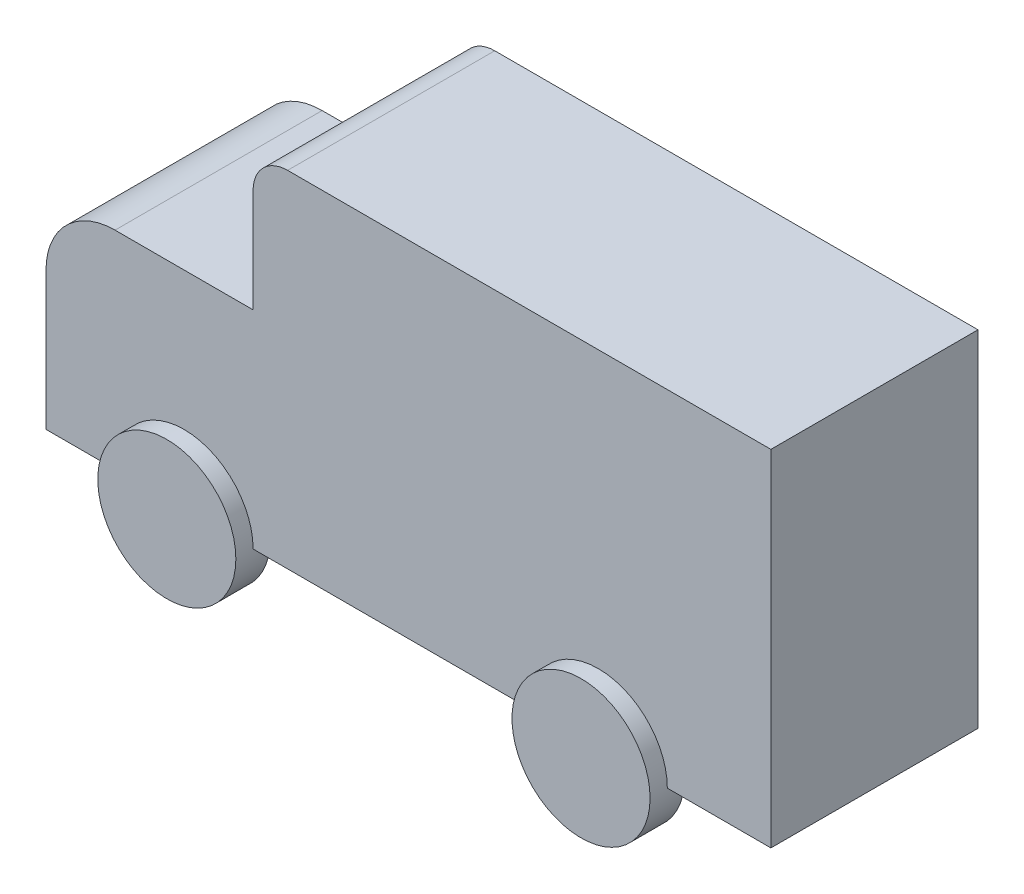
ISO-10303-21;
HEADER;
FILE_DESCRIPTION(('STEP AP214'),'2;1');
FILE_NAME('part.step','',(''),(''),'','','');
FILE_SCHEMA(('AUTOMOTIVE_DESIGN { 1 0 10303 214 1 1 1 1 }'));
ENDSEC;
DATA;
#1=APPLICATION_CONTEXT('core data for automotive mechanical design processes');
#2=APPLICATION_PROTOCOL_DEFINITION('international standard','automotive_design',2000,#1);
#3=PRODUCT_CONTEXT('',#1,'mechanical');
#4=PRODUCT('Part','Part','',(#3));
#5=PRODUCT_RELATED_PRODUCT_CATEGORY('part','',(#4));
#6=PRODUCT_DEFINITION_FORMATION('','',#4);
#7=PRODUCT_DEFINITION_CONTEXT('part definition',#1,'design');
#8=PRODUCT_DEFINITION('design','',#6,#7);
#9=PRODUCT_DEFINITION_SHAPE('','',#8);
#10=(LENGTH_UNIT() NAMED_UNIT(*) SI_UNIT(.MILLI.,.METRE.));
#11=(NAMED_UNIT(*) PLANE_ANGLE_UNIT() SI_UNIT($,.RADIAN.));
#12=(NAMED_UNIT(*) SI_UNIT($,.STERADIAN.) SOLID_ANGLE_UNIT());
#13=UNCERTAINTY_MEASURE_WITH_UNIT(LENGTH_MEASURE(1.E-05),#10,'distance_accuracy_value','');
#14=(GEOMETRIC_REPRESENTATION_CONTEXT(3) GLOBAL_UNCERTAINTY_ASSIGNED_CONTEXT((#13)) GLOBAL_UNIT_ASSIGNED_CONTEXT((#10,
#11,#12)) REPRESENTATION_CONTEXT('',''));
#15=CARTESIAN_POINT('',(0.,0.,0.));
#16=DIRECTION('',(0.,0.,1.));
#17=DIRECTION('',(1.,0.,0.));
#18=AXIS2_PLACEMENT_3D('',#15,#16,#17);
#19=CARTESIAN_POINT('',(0.,-1000.,-600.));
#20=DIRECTION('',(0.,-1.,0.));
#21=DIRECTION('',(1.,0.,0.));
#22=AXIS2_PLACEMENT_3D('',#19,#20,#21);
#23=PLANE('',#22);
#24=DIRECTION('',(0.,0.,1.));
#25=VECTOR('',#24,1.);
#26=CARTESIAN_POINT('',(900.,-1000.,-700.));
#27=LINE('',#26,#25);
#28=CARTESIAN_POINT('',(900.,-1000.,-600.));
#29=VERTEX_POINT('',#28);
#30=CARTESIAN_POINT('',(900.,-1000.,-500.));
#31=VERTEX_POINT('',#30);
#32=EDGE_CURVE('E146',#29,#31,#27,.T.);
#33=ORIENTED_EDGE('',*,*,#32,.F.);
#34=DIRECTION('',(1.,0.,0.));
#35=VECTOR('',#34,1.);
#36=CARTESIAN_POINT('',(0.,-1000.,-600.));
#37=LINE('',#36,#35);
#38=CARTESIAN_POINT('',(1500.,-1000.,-600.));
#39=VERTEX_POINT('',#38);
#40=EDGE_CURVE('E206',#29,#39,#37,.T.);
#41=ORIENTED_EDGE('',*,*,#40,.T.);
#42=DIRECTION('',(0.,0.,1.));
#43=VECTOR('',#42,1.);
#44=CARTESIAN_POINT('',(1500.,-1000.,-600.));
#45=LINE('',#44,#43);
#46=CARTESIAN_POINT('',(1500.,-1000.,600.));
#47=VERTEX_POINT('',#46);
#48=EDGE_CURVE('E258',#39,#47,#45,.T.);
#49=ORIENTED_EDGE('',*,*,#48,.T.);
#50=DIRECTION('',(1.,0.,0.));
#51=VECTOR('',#50,1.);
#52=CARTESIAN_POINT('',(0.,-1000.,600.));
#53=LINE('',#52,#51);
#54=CARTESIAN_POINT('',(900.,-1000.,600.));
#55=VERTEX_POINT('',#54);
#56=EDGE_CURVE('E227',#55,#47,#53,.T.);
#57=ORIENTED_EDGE('',*,*,#56,.F.);
#58=DIRECTION('',(0.,0.,-1.));
#59=VECTOR('',#58,1.);
#60=CARTESIAN_POINT('',(900.,-1000.,700.));
#61=LINE('',#60,#59);
#62=CARTESIAN_POINT('',(900.,-1000.,500.));
#63=VERTEX_POINT('',#62);
#64=EDGE_CURVE('E178',#55,#63,#61,.T.);
#65=ORIENTED_EDGE('',*,*,#64,.T.);
#66=DIRECTION('',(-1.,0.,0.));
#67=VECTOR('',#66,1.);
#68=CARTESIAN_POINT('',(0.,-1000.,500.));
#69=LINE('',#68,#67);
#70=CARTESIAN_POINT('',(99.9999999999995,-1000.,500.));
#71=VERTEX_POINT('',#70);
#72=EDGE_CURVE('E272',#63,#71,#69,.T.);
#73=ORIENTED_EDGE('',*,*,#72,.T.);
#74=DIRECTION('',(0.,0.,-1.));
#75=VECTOR('',#74,1.);
#76=CARTESIAN_POINT('',(99.9999999999995,-1000.,700.));
#77=LINE('',#76,#75);
#78=CARTESIAN_POINT('',(99.9999999999995,-1000.,600.));
#79=VERTEX_POINT('',#78);
#80=EDGE_CURVE('E183',#71,#79,#77,.F.);
#81=ORIENTED_EDGE('',*,*,#80,.T.);
#82=CARTESIAN_POINT('',(-1500.,-1000.,600.));
#83=VERTEX_POINT('',#82);
#84=EDGE_CURVE('E232',#83,#79,#53,.T.);
#85=ORIENTED_EDGE('',*,*,#84,.F.);
#86=DIRECTION('',(0.,0.,-1.));
#87=VECTOR('',#86,1.);
#88=CARTESIAN_POINT('',(-1500.,-1000.,700.));
#89=LINE('',#88,#87);
#90=CARTESIAN_POINT('',(-1500.,-1000.,500.));
#91=VERTEX_POINT('',#90);
#92=EDGE_CURVE('E190',#83,#91,#89,.T.);
#93=ORIENTED_EDGE('',*,*,#92,.T.);
#94=DIRECTION('',(-1.,0.,0.));
#95=VECTOR('',#94,1.);
#96=CARTESIAN_POINT('',(0.,-1000.,500.));
#97=LINE('',#96,#95);
#98=CARTESIAN_POINT('',(-2300.,-1000.,500.));
#99=VERTEX_POINT('',#98);
#100=EDGE_CURVE('E266',#91,#99,#97,.T.);
#101=ORIENTED_EDGE('',*,*,#100,.T.);
#102=DIRECTION('',(0.,0.,-1.));
#103=VECTOR('',#102,1.);
#104=CARTESIAN_POINT('',(-2300.,-1000.,700.));
#105=LINE('',#104,#103);
#106=CARTESIAN_POINT('',(-2300.,-1000.,600.));
#107=VERTEX_POINT('',#106);
#108=EDGE_CURVE('E195',#99,#107,#105,.F.);
#109=ORIENTED_EDGE('',*,*,#108,.T.);
#110=CARTESIAN_POINT('',(-2700.,-1000.,600.));
#111=VERTEX_POINT('',#110);
#112=EDGE_CURVE('E228',#111,#107,#53,.T.);
#113=ORIENTED_EDGE('',*,*,#112,.F.);
#114=DIRECTION('',(0.,0.,1.));
#115=VECTOR('',#114,1.);
#116=CARTESIAN_POINT('',(-2700.,-1000.,-600.));
#117=LINE('',#116,#115);
#118=CARTESIAN_POINT('',(-2700.,-1000.,-600.));
#119=VERTEX_POINT('',#118);
#120=EDGE_CURVE('E261',#119,#111,#117,.T.);
#121=ORIENTED_EDGE('',*,*,#120,.F.);
#122=CARTESIAN_POINT('',(-2300.,-1000.,-600.));
#123=VERTEX_POINT('',#122);
#124=EDGE_CURVE('E207',#119,#123,#37,.T.);
#125=ORIENTED_EDGE('',*,*,#124,.T.);
#126=DIRECTION('',(0.,0.,1.));
#127=VECTOR('',#126,1.);
#128=CARTESIAN_POINT('',(-2300.,-1000.,-700.));
#129=LINE('',#128,#127);
#130=CARTESIAN_POINT('',(-2300.,-1000.,-500.));
#131=VERTEX_POINT('',#130);
#132=EDGE_CURVE('E56',#131,#123,#129,.F.);
#133=ORIENTED_EDGE('',*,*,#132,.F.);
#134=DIRECTION('',(1.,0.,0.));
#135=VECTOR('',#134,1.);
#136=CARTESIAN_POINT('',(0.,-1000.,-500.));
#137=LINE('',#136,#135);
#138=CARTESIAN_POINT('',(-1500.,-1000.,-500.));
#139=VERTEX_POINT('',#138);
#140=EDGE_CURVE('E277',#131,#139,#137,.T.);
#141=ORIENTED_EDGE('',*,*,#140,.T.);
#142=DIRECTION('',(0.,0.,1.));
#143=VECTOR('',#142,1.);
#144=CARTESIAN_POINT('',(-1500.,-1000.,-700.));
#145=LINE('',#144,#143);
#146=CARTESIAN_POINT('',(-1500.,-1000.,-600.));
#147=VERTEX_POINT('',#146);
#148=EDGE_CURVE('E172',#147,#139,#145,.T.);
#149=ORIENTED_EDGE('',*,*,#148,.F.);
#150=CARTESIAN_POINT('',(99.9999999999995,-1000.,-600.));
#151=VERTEX_POINT('',#150);
#152=EDGE_CURVE('E161',#147,#151,#37,.T.);
#153=ORIENTED_EDGE('',*,*,#152,.T.);
#154=DIRECTION('',(0.,0.,1.));
#155=VECTOR('',#154,1.);
#156=CARTESIAN_POINT('',(99.9999999999995,-1000.,-700.));
#157=LINE('',#156,#155);
#158=CARTESIAN_POINT('',(99.9999999999995,-1000.,-500.));
#159=VERTEX_POINT('',#158);
#160=EDGE_CURVE('E48',#159,#151,#157,.F.);
#161=ORIENTED_EDGE('',*,*,#160,.F.);
#162=DIRECTION('',(1.,0.,0.));
#163=VECTOR('',#162,1.);
#164=CARTESIAN_POINT('',(0.,-1000.,-500.));
#165=LINE('',#164,#163);
#166=EDGE_CURVE('E11',#159,#31,#165,.T.);
#167=ORIENTED_EDGE('',*,*,#166,.T.);
#168=EDGE_LOOP('',(#33,#41,#49,#57,#65,#73,#81,#85,#93,#101,#109,#113,#121,#125,#133,#141,#149,
#153,#161,#167));
#169=FACE_BOUND('',#168,.T.);
#170=ADVANCED_FACE('F33',(#169),#23,.T.);
#171=CARTESIAN_POINT('',(-2300.,-200.,-600.));
#172=DIRECTION('',(0.,0.,1.));
#173=DIRECTION('',(1.,0.,0.));
#174=AXIS2_PLACEMENT_3D('',#171,#172,#173);
#175=CYLINDRICAL_SURFACE('',#174,400.);
#176=CARTESIAN_POINT('',(-2300.,-200.,600.));
#177=DIRECTION('',(0.,0.,1.));
#178=DIRECTION('',(1.,0.,0.));
#179=AXIS2_PLACEMENT_3D('',#176,#177,#178);
#180=CIRCLE('',#179,400.);
#181=CARTESIAN_POINT('',(-2700.,-200.000000000003,600.));
#182=VERTEX_POINT('',#181);
#183=CARTESIAN_POINT('',(-2300.,200.,600.));
#184=VERTEX_POINT('',#183);
#185=EDGE_CURVE('E198',#182,#184,#180,.F.);
#186=ORIENTED_EDGE('',*,*,#185,.T.);
#187=DIRECTION('',(0.,0.,1.));
#188=VECTOR('',#187,1.);
#189=CARTESIAN_POINT('',(-2300.,200.,-600.));
#190=LINE('',#189,#188);
#191=CARTESIAN_POINT('',(-2300.,200.,-600.));
#192=VERTEX_POINT('',#191);
#193=EDGE_CURVE('E243',#192,#184,#190,.T.);
#194=ORIENTED_EDGE('',*,*,#193,.F.);
#195=CARTESIAN_POINT('',(-2300.,-200.,-600.));
#196=DIRECTION('',(0.,0.,1.));
#197=DIRECTION('',(1.,0.,0.));
#198=AXIS2_PLACEMENT_3D('',#195,#196,#197);
#199=CIRCLE('',#198,400.);
#200=CARTESIAN_POINT('',(-2700.,-200.000000000003,-600.));
#201=VERTEX_POINT('',#200);
#202=EDGE_CURVE('E199',#201,#192,#199,.F.);
#203=ORIENTED_EDGE('',*,*,#202,.F.);
#204=DIRECTION('',(0.,0.,1.));
#205=VECTOR('',#204,1.);
#206=CARTESIAN_POINT('',(-2700.,-200.000000000003,-600.));
#207=LINE('',#206,#205);
#208=EDGE_CURVE('E221',#201,#182,#207,.T.);
#209=ORIENTED_EDGE('',*,*,#208,.T.);
#210=EDGE_LOOP('',(#186,#194,#203,#209));
#211=FACE_BOUND('',#210,.T.);
#212=ADVANCED_FACE('F35',(#211),#175,.T.);
#213=CARTESIAN_POINT('',(0.,200.,-600.));
#214=DIRECTION('',(0.,-1.,0.));
#215=DIRECTION('',(0.,0.,-1.));
#216=AXIS2_PLACEMENT_3D('',#213,#214,#215);
#217=PLANE('',#216);
#218=DIRECTION('',(1.,0.,0.));
#219=VECTOR('',#218,1.);
#220=CARTESIAN_POINT('',(0.,200.,600.));
#221=LINE('',#220,#219);
#222=CARTESIAN_POINT('',(-1500.,200.,600.));
#223=VERTEX_POINT('',#222);
#224=EDGE_CURVE('E203',#184,#223,#221,.T.);
#225=ORIENTED_EDGE('',*,*,#224,.T.);
#226=DIRECTION('',(0.,0.,1.));
#227=VECTOR('',#226,1.);
#228=CARTESIAN_POINT('',(-1500.,200.,-600.));
#229=LINE('',#228,#227);
#230=CARTESIAN_POINT('',(-1500.,200.,-600.));
#231=VERTEX_POINT('',#230);
#232=EDGE_CURVE('E247',#231,#223,#229,.T.);
#233=ORIENTED_EDGE('',*,*,#232,.F.);
#234=DIRECTION('',(1.,0.,0.));
#235=VECTOR('',#234,1.);
#236=CARTESIAN_POINT('',(0.,200.,-600.));
#237=LINE('',#236,#235);
#238=EDGE_CURVE('E219',#192,#231,#237,.T.);
#239=ORIENTED_EDGE('',*,*,#238,.F.);
#240=ORIENTED_EDGE('',*,*,#193,.T.);
#241=EDGE_LOOP('',(#225,#233,#239,#240));
#242=FACE_BOUND('',#241,.T.);
#243=ADVANCED_FACE('F319',(#242),#217,.F.);
#244=CARTESIAN_POINT('',(-1500.,0.,-600.));
#245=DIRECTION('',(1.,0.,0.));
#246=DIRECTION('',(0.,0.,-1.));
#247=AXIS2_PLACEMENT_3D('',#244,#245,#246);
#248=PLANE('',#247);
#249=DIRECTION('',(0.,1.,0.));
#250=VECTOR('',#249,1.);
#251=CARTESIAN_POINT('',(-1500.,0.,600.));
#252=LINE('',#251,#250);
#253=CARTESIAN_POINT('',(-1500.,799.999999999999,600.));
#254=VERTEX_POINT('',#253);
#255=EDGE_CURVE('E240',#223,#254,#252,.T.);
#256=ORIENTED_EDGE('',*,*,#255,.T.);
#257=DIRECTION('',(0.,0.,1.));
#258=VECTOR('',#257,1.);
#259=CARTESIAN_POINT('',(-1500.,799.999999999999,-600.));
#260=LINE('',#259,#258);
#261=CARTESIAN_POINT('',(-1500.,799.999999999999,-600.));
#262=VERTEX_POINT('',#261);
#263=EDGE_CURVE('E250',#262,#254,#260,.T.);
#264=ORIENTED_EDGE('',*,*,#263,.F.);
#265=DIRECTION('',(0.,1.,0.));
#266=VECTOR('',#265,1.);
#267=CARTESIAN_POINT('',(-1500.,0.,-600.));
#268=LINE('',#267,#266);
#269=EDGE_CURVE('E217',#231,#262,#268,.T.);
#270=ORIENTED_EDGE('',*,*,#269,.F.);
#271=ORIENTED_EDGE('',*,*,#232,.T.);
#272=EDGE_LOOP('',(#256,#264,#270,#271));
#273=FACE_BOUND('',#272,.T.);
#274=ADVANCED_FACE('F362',(#273),#248,.F.);
#275=CARTESIAN_POINT('',(-1300.,800.,-600.));
#276=DIRECTION('',(0.,0.,1.));
#277=DIRECTION('',(1.,0.,0.));
#278=AXIS2_PLACEMENT_3D('',#275,#276,#277);
#279=CYLINDRICAL_SURFACE('',#278,200.);
#280=CARTESIAN_POINT('',(-1300.,800.,600.));
#281=DIRECTION('',(0.,0.,1.));
#282=DIRECTION('',(1.,0.,0.));
#283=AXIS2_PLACEMENT_3D('',#280,#281,#282);
#284=CIRCLE('',#283,200.);
#285=CARTESIAN_POINT('',(-1300.,1000.,600.));
#286=VERTEX_POINT('',#285);
#287=EDGE_CURVE('E238',#254,#286,#284,.F.);
#288=ORIENTED_EDGE('',*,*,#287,.T.);
#289=DIRECTION('',(0.,0.,1.));
#290=VECTOR('',#289,1.);
#291=CARTESIAN_POINT('',(-1300.,1000.,-600.));
#292=LINE('',#291,#290);
#293=CARTESIAN_POINT('',(-1300.,1000.,-600.));
#294=VERTEX_POINT('',#293);
#295=EDGE_CURVE('E253',#294,#286,#292,.T.);
#296=ORIENTED_EDGE('',*,*,#295,.F.);
#297=CARTESIAN_POINT('',(-1300.,800.,-600.));
#298=DIRECTION('',(0.,0.,1.));
#299=DIRECTION('',(1.,0.,0.));
#300=AXIS2_PLACEMENT_3D('',#297,#298,#299);
#301=CIRCLE('',#300,200.);
#302=EDGE_CURVE('E215',#262,#294,#301,.F.);
#303=ORIENTED_EDGE('',*,*,#302,.F.);
#304=ORIENTED_EDGE('',*,*,#263,.T.);
#305=EDGE_LOOP('',(#288,#296,#303,#304));
#306=FACE_BOUND('',#305,.T.);
#307=ADVANCED_FACE('F366',(#306),#279,.T.);
#308=CARTESIAN_POINT('',(0.,1000.,-600.));
#309=DIRECTION('',(0.,-1.,0.));
#310=DIRECTION('',(0.,0.,-1.));
#311=AXIS2_PLACEMENT_3D('',#308,#309,#310);
#312=PLANE('',#311);
#313=DIRECTION('',(1.,0.,0.));
#314=VECTOR('',#313,1.);
#315=CARTESIAN_POINT('',(0.,1000.,600.));
#316=LINE('',#315,#314);
#317=CARTESIAN_POINT('',(1500.,1000.,600.));
#318=VERTEX_POINT('',#317);
#319=EDGE_CURVE('E235',#286,#318,#316,.T.);
#320=ORIENTED_EDGE('',*,*,#319,.T.);
#321=DIRECTION('',(0.,0.,1.));
#322=VECTOR('',#321,1.);
#323=CARTESIAN_POINT('',(1500.,1000.,-600.));
#324=LINE('',#323,#322);
#325=CARTESIAN_POINT('',(1500.,1000.,-600.));
#326=VERTEX_POINT('',#325);
#327=EDGE_CURVE('E256',#326,#318,#324,.T.);
#328=ORIENTED_EDGE('',*,*,#327,.F.);
#329=DIRECTION('',(1.,0.,0.));
#330=VECTOR('',#329,1.);
#331=CARTESIAN_POINT('',(0.,1000.,-600.));
#332=LINE('',#331,#330);
#333=EDGE_CURVE('E213',#294,#326,#332,.T.);
#334=ORIENTED_EDGE('',*,*,#333,.F.);
#335=ORIENTED_EDGE('',*,*,#295,.T.);
#336=EDGE_LOOP('',(#320,#328,#334,#335));
#337=FACE_BOUND('',#336,.T.);
#338=ADVANCED_FACE('F331',(#337),#312,.F.);
#339=CARTESIAN_POINT('',(1500.,0.,-600.));
#340=DIRECTION('',(1.,0.,0.));
#341=DIRECTION('',(0.,0.,-1.));
#342=AXIS2_PLACEMENT_3D('',#339,#340,#341);
#343=PLANE('',#342);
#344=DIRECTION('',(0.,1.,0.));
#345=VECTOR('',#344,1.);
#346=CARTESIAN_POINT('',(1500.,0.,600.));
#347=LINE('',#346,#345);
#348=EDGE_CURVE('E231',#47,#318,#347,.T.);
#349=ORIENTED_EDGE('',*,*,#348,.F.);
#350=ORIENTED_EDGE('',*,*,#48,.F.);
#351=DIRECTION('',(0.,1.,0.));
#352=VECTOR('',#351,1.);
#353=CARTESIAN_POINT('',(1500.,0.,-600.));
#354=LINE('',#353,#352);
#355=EDGE_CURVE('E210',#39,#326,#354,.T.);
#356=ORIENTED_EDGE('',*,*,#355,.T.);
#357=ORIENTED_EDGE('',*,*,#327,.T.);
#358=EDGE_LOOP('',(#349,#350,#356,#357));
#359=FACE_BOUND('',#358,.T.);
#360=ADVANCED_FACE('F286',(#359),#343,.T.);
#361=CARTESIAN_POINT('',(-2700.,0.,-600.));
#362=DIRECTION('',(-1.,0.,0.));
#363=DIRECTION('',(0.,0.,1.));
#364=AXIS2_PLACEMENT_3D('',#361,#362,#363);
#365=PLANE('',#364);
#366=DIRECTION('',(0.,-1.,0.));
#367=VECTOR('',#366,1.);
#368=CARTESIAN_POINT('',(-2700.,0.,600.));
#369=LINE('',#368,#367);
#370=EDGE_CURVE('E224',#182,#111,#369,.T.);
#371=ORIENTED_EDGE('',*,*,#370,.F.);
#372=ORIENTED_EDGE('',*,*,#208,.F.);
#373=DIRECTION('',(0.,-1.,0.));
#374=VECTOR('',#373,1.);
#375=CARTESIAN_POINT('',(-2700.,0.,-600.));
#376=LINE('',#375,#374);
#377=EDGE_CURVE('E202',#201,#119,#376,.T.);
#378=ORIENTED_EDGE('',*,*,#377,.T.);
#379=ORIENTED_EDGE('',*,*,#120,.T.);
#380=EDGE_LOOP('',(#371,#372,#378,#379));
#381=FACE_BOUND('',#380,.T.);
#382=ADVANCED_FACE('F323',(#381),#365,.T.);
#383=CARTESIAN_POINT('',(0.,0.,-600.));
#384=DIRECTION('',(0.,0.,1.));
#385=DIRECTION('',(1.,0.,0.));
#386=AXIS2_PLACEMENT_3D('',#383,#384,#385);
#387=PLANE('',#386);
#388=ORIENTED_EDGE('',*,*,#40,.F.);
#389=CARTESIAN_POINT('',(500.,-1000.,-600.));
#390=DIRECTION('',(0.,0.,1.));
#391=DIRECTION('',(1.,0.,0.));
#392=AXIS2_PLACEMENT_3D('',#389,#390,#391);
#393=CIRCLE('',#392,400.);
#394=EDGE_CURVE('E41',#29,#151,#393,.T.);
#395=ORIENTED_EDGE('',*,*,#394,.T.);
#396=ORIENTED_EDGE('',*,*,#152,.F.);
#397=CARTESIAN_POINT('',(-1900.,-1000.,-600.));
#398=DIRECTION('',(0.,0.,1.));
#399=DIRECTION('',(1.,0.,0.));
#400=AXIS2_PLACEMENT_3D('',#397,#398,#399);
#401=CIRCLE('',#400,400.);
#402=EDGE_CURVE('E275',#147,#123,#401,.T.);
#403=ORIENTED_EDGE('',*,*,#402,.T.);
#404=ORIENTED_EDGE('',*,*,#124,.F.);
#405=ORIENTED_EDGE('',*,*,#377,.F.);
#406=ORIENTED_EDGE('',*,*,#202,.T.);
#407=ORIENTED_EDGE('',*,*,#238,.T.);
#408=ORIENTED_EDGE('',*,*,#269,.T.);
#409=ORIENTED_EDGE('',*,*,#302,.T.);
#410=ORIENTED_EDGE('',*,*,#333,.T.);
#411=ORIENTED_EDGE('',*,*,#355,.F.);
#412=EDGE_LOOP('',(#388,#395,#396,#403,#404,#405,#406,#407,#408,#409,#410,#411));
#413=FACE_BOUND('',#412,.T.);
#414=ADVANCED_FACE('F280',(#413),#387,.F.);
#415=CARTESIAN_POINT('',(0.,0.,600.));
#416=DIRECTION('',(0.,0.,1.));
#417=DIRECTION('',(1.,0.,0.));
#418=AXIS2_PLACEMENT_3D('',#415,#416,#417);
#419=PLANE('',#418);
#420=ORIENTED_EDGE('',*,*,#84,.T.);
#421=CARTESIAN_POINT('',(500.,-1000.,600.));
#422=DIRECTION('',(0.,0.,1.));
#423=DIRECTION('',(1.,0.,0.));
#424=AXIS2_PLACEMENT_3D('',#421,#422,#423);
#425=CIRCLE('',#424,400.);
#426=EDGE_CURVE('E269',#79,#55,#425,.F.);
#427=ORIENTED_EDGE('',*,*,#426,.T.);
#428=ORIENTED_EDGE('',*,*,#56,.T.);
#429=ORIENTED_EDGE('',*,*,#348,.T.);
#430=ORIENTED_EDGE('',*,*,#319,.F.);
#431=ORIENTED_EDGE('',*,*,#287,.F.);
#432=ORIENTED_EDGE('',*,*,#255,.F.);
#433=ORIENTED_EDGE('',*,*,#224,.F.);
#434=ORIENTED_EDGE('',*,*,#185,.F.);
#435=ORIENTED_EDGE('',*,*,#370,.T.);
#436=ORIENTED_EDGE('',*,*,#112,.T.);
#437=CARTESIAN_POINT('',(-1900.,-1000.,600.));
#438=DIRECTION('',(0.,0.,1.));
#439=DIRECTION('',(1.,0.,0.));
#440=AXIS2_PLACEMENT_3D('',#437,#438,#439);
#441=CIRCLE('',#440,400.);
#442=EDGE_CURVE('E246',#107,#83,#441,.F.);
#443=ORIENTED_EDGE('',*,*,#442,.T.);
#444=EDGE_LOOP('',(#420,#427,#428,#429,#430,#431,#432,#433,#434,#435,#436,#443));
#445=FACE_BOUND('',#444,.T.);
#446=ADVANCED_FACE('F291',(#445),#419,.T.);
#447=CARTESIAN_POINT('',(-1900.,-1000.,700.));
#448=DIRECTION('',(0.,0.,-1.));
#449=DIRECTION('',(-1.,0.,0.));
#450=AXIS2_PLACEMENT_3D('',#447,#448,#449);
#451=CYLINDRICAL_SURFACE('',#450,400.);
#452=ORIENTED_EDGE('',*,*,#108,.F.);
#453=CARTESIAN_POINT('',(-1900.,-1000.,500.));
#454=DIRECTION('',(0.,0.,1.));
#455=DIRECTION('',(1.,0.,0.));
#456=AXIS2_PLACEMENT_3D('',#453,#454,#455);
#457=CIRCLE('',#456,400.);
#458=EDGE_CURVE('E186',#99,#91,#457,.T.);
#459=ORIENTED_EDGE('',*,*,#458,.T.);
#460=ORIENTED_EDGE('',*,*,#92,.F.);
#461=ORIENTED_EDGE('',*,*,#442,.F.);
#462=EDGE_LOOP('',(#452,#459,#460,#461));
#463=FACE_BOUND('',#462,.T.);
#464=CARTESIAN_POINT('',(-1900.,-1000.,700.));
#465=DIRECTION('',(0.,0.,1.));
#466=DIRECTION('',(1.,0.,0.));
#467=AXIS2_PLACEMENT_3D('',#464,#465,#466);
#468=CIRCLE('',#467,400.);
#469=CARTESIAN_POINT('',(-1500.,-1000.,700.));
#470=VERTEX_POINT('',#469);
#471=EDGE_CURVE('E187',#470,#470,#468,.T.);
#472=ORIENTED_EDGE('',*,*,#471,.F.);
#473=EDGE_LOOP('',(#472));
#474=FACE_BOUND('',#473,.T.);
#475=ADVANCED_FACE('F342',(#463,#474),#451,.T.);
#476=CARTESIAN_POINT('',(0.,0.,700.));
#477=DIRECTION('',(0.,0.,1.));
#478=DIRECTION('',(1.,0.,0.));
#479=AXIS2_PLACEMENT_3D('',#476,#477,#478);
#480=PLANE('',#479);
#481=ORIENTED_EDGE('',*,*,#471,.T.);
#482=EDGE_LOOP('',(#481));
#483=FACE_BOUND('',#482,.T.);
#484=ADVANCED_FACE('F347',(#483),#480,.T.);
#485=CARTESIAN_POINT('',(0.,0.,500.));
#486=DIRECTION('',(0.,0.,1.));
#487=DIRECTION('',(1.,0.,0.));
#488=AXIS2_PLACEMENT_3D('',#485,#486,#487);
#489=PLANE('',#488);
#490=ORIENTED_EDGE('',*,*,#100,.F.);
#491=ORIENTED_EDGE('',*,*,#458,.F.);
#492=EDGE_LOOP('',(#490,#491));
#493=FACE_BOUND('',#492,.T.);
#494=ADVANCED_FACE('F345',(#493),#489,.F.);
#495=CARTESIAN_POINT('',(500.,-1000.,700.));
#496=DIRECTION('',(0.,0.,-1.));
#497=DIRECTION('',(-1.,0.,0.));
#498=AXIS2_PLACEMENT_3D('',#495,#496,#497);
#499=CYLINDRICAL_SURFACE('',#498,400.);
#500=ORIENTED_EDGE('',*,*,#80,.F.);
#501=CARTESIAN_POINT('',(500.,-1000.,500.));
#502=DIRECTION('',(0.,0.,1.));
#503=DIRECTION('',(1.,0.,0.));
#504=AXIS2_PLACEMENT_3D('',#501,#502,#503);
#505=CIRCLE('',#504,400.);
#506=EDGE_CURVE('E174',#71,#63,#505,.T.);
#507=ORIENTED_EDGE('',*,*,#506,.T.);
#508=ORIENTED_EDGE('',*,*,#64,.F.);
#509=ORIENTED_EDGE('',*,*,#426,.F.);
#510=EDGE_LOOP('',(#500,#507,#508,#509));
#511=FACE_BOUND('',#510,.T.);
#512=CARTESIAN_POINT('',(500.,-1000.,700.));
#513=DIRECTION('',(0.,0.,1.));
#514=DIRECTION('',(1.,0.,0.));
#515=AXIS2_PLACEMENT_3D('',#512,#513,#514);
#516=CIRCLE('',#515,400.);
#517=CARTESIAN_POINT('',(900.,-1000.,700.));
#518=VERTEX_POINT('',#517);
#519=EDGE_CURVE('E175',#518,#518,#516,.T.);
#520=ORIENTED_EDGE('',*,*,#519,.F.);
#521=EDGE_LOOP('',(#520));
#522=FACE_BOUND('',#521,.T.);
#523=ADVANCED_FACE('F296',(#511,#522),#499,.T.);
#524=CARTESIAN_POINT('',(0.,0.,700.));
#525=DIRECTION('',(0.,0.,1.));
#526=DIRECTION('',(1.,0.,0.));
#527=AXIS2_PLACEMENT_3D('',#524,#525,#526);
#528=PLANE('',#527);
#529=ORIENTED_EDGE('',*,*,#519,.T.);
#530=EDGE_LOOP('',(#529));
#531=FACE_BOUND('',#530,.T.);
#532=ADVANCED_FACE('F302',(#531),#528,.T.);
#533=CARTESIAN_POINT('',(0.,0.,500.));
#534=DIRECTION('',(0.,0.,1.));
#535=DIRECTION('',(1.,0.,0.));
#536=AXIS2_PLACEMENT_3D('',#533,#534,#535);
#537=PLANE('',#536);
#538=ORIENTED_EDGE('',*,*,#72,.F.);
#539=ORIENTED_EDGE('',*,*,#506,.F.);
#540=EDGE_LOOP('',(#538,#539));
#541=FACE_BOUND('',#540,.T.);
#542=ADVANCED_FACE('F299',(#541),#537,.F.);
#543=CARTESIAN_POINT('',(-1900.,-1000.,-700.));
#544=DIRECTION('',(0.,0.,1.));
#545=DIRECTION('',(1.,0.,0.));
#546=AXIS2_PLACEMENT_3D('',#543,#544,#545);
#547=CYLINDRICAL_SURFACE('',#546,400.);
#548=CARTESIAN_POINT('',(-1900.,-1000.,-700.));
#549=DIRECTION('',(0.,0.,1.));
#550=DIRECTION('',(1.,0.,0.));
#551=AXIS2_PLACEMENT_3D('',#548,#549,#550);
#552=CIRCLE('',#551,400.);
#553=CARTESIAN_POINT('',(-1500.,-1000.,-700.));
#554=VERTEX_POINT('',#553);
#555=EDGE_CURVE('E166',#554,#554,#552,.T.);
#556=ORIENTED_EDGE('',*,*,#555,.T.);
#557=EDGE_LOOP('',(#556));
#558=FACE_BOUND('',#557,.T.);
#559=ORIENTED_EDGE('',*,*,#402,.F.);
#560=ORIENTED_EDGE('',*,*,#148,.T.);
#561=CARTESIAN_POINT('',(-1900.,-1000.,-500.));
#562=DIRECTION('',(0.,0.,1.));
#563=DIRECTION('',(1.,0.,0.));
#564=AXIS2_PLACEMENT_3D('',#561,#562,#563);
#565=CIRCLE('',#564,400.);
#566=EDGE_CURVE('E152',#131,#139,#565,.T.);
#567=ORIENTED_EDGE('',*,*,#566,.F.);
#568=ORIENTED_EDGE('',*,*,#132,.T.);
#569=EDGE_LOOP('',(#559,#560,#567,#568));
#570=FACE_BOUND('',#569,.T.);
#571=ADVANCED_FACE('F301',(#558,#570),#547,.T.);
#572=CARTESIAN_POINT('',(0.,0.,-700.));
#573=DIRECTION('',(0.,0.,-1.));
#574=DIRECTION('',(1.,0.,0.));
#575=AXIS2_PLACEMENT_3D('',#572,#573,#574);
#576=PLANE('',#575);
#577=ORIENTED_EDGE('',*,*,#555,.F.);
#578=EDGE_LOOP('',(#577));
#579=FACE_BOUND('',#578,.T.);
#580=ADVANCED_FACE('F308',(#579),#576,.T.);
#581=CARTESIAN_POINT('',(0.,0.,-500.));
#582=DIRECTION('',(0.,0.,-1.));
#583=DIRECTION('',(1.,0.,0.));
#584=AXIS2_PLACEMENT_3D('',#581,#582,#583);
#585=PLANE('',#584);
#586=ORIENTED_EDGE('',*,*,#140,.F.);
#587=ORIENTED_EDGE('',*,*,#566,.T.);
#588=EDGE_LOOP('',(#586,#587));
#589=FACE_BOUND('',#588,.T.);
#590=ADVANCED_FACE('F463',(#589),#585,.F.);
#591=CARTESIAN_POINT('',(500.,-1000.,-700.));
#592=DIRECTION('',(0.,0.,1.));
#593=DIRECTION('',(1.,0.,0.));
#594=AXIS2_PLACEMENT_3D('',#591,#592,#593);
#595=CYLINDRICAL_SURFACE('',#594,400.);
#596=CARTESIAN_POINT('',(500.,-1000.,-700.));
#597=DIRECTION('',(0.,0.,1.));
#598=DIRECTION('',(1.,0.,0.));
#599=AXIS2_PLACEMENT_3D('',#596,#597,#598);
#600=CIRCLE('',#599,400.);
#601=CARTESIAN_POINT('',(900.,-1000.,-700.));
#602=VERTEX_POINT('',#601);
#603=EDGE_CURVE('E156',#602,#602,#600,.T.);
#604=ORIENTED_EDGE('',*,*,#603,.T.);
#605=EDGE_LOOP('',(#604));
#606=FACE_BOUND('',#605,.T.);
#607=ORIENTED_EDGE('',*,*,#394,.F.);
#608=ORIENTED_EDGE('',*,*,#32,.T.);
#609=CARTESIAN_POINT('',(500.,-1000.,-500.));
#610=DIRECTION('',(0.,0.,1.));
#611=DIRECTION('',(1.,0.,0.));
#612=AXIS2_PLACEMENT_3D('',#609,#610,#611);
#613=CIRCLE('',#612,400.);
#614=EDGE_CURVE('E149',#159,#31,#613,.T.);
#615=ORIENTED_EDGE('',*,*,#614,.F.);
#616=ORIENTED_EDGE('',*,*,#160,.T.);
#617=EDGE_LOOP('',(#607,#608,#615,#616));
#618=FACE_BOUND('',#617,.T.);
#619=ADVANCED_FACE('F148',(#606,#618),#595,.T.);
#620=CARTESIAN_POINT('',(0.,0.,-700.));
#621=DIRECTION('',(0.,0.,-1.));
#622=DIRECTION('',(1.,0.,0.));
#623=AXIS2_PLACEMENT_3D('',#620,#621,#622);
#624=PLANE('',#623);
#625=ORIENTED_EDGE('',*,*,#603,.F.);
#626=EDGE_LOOP('',(#625));
#627=FACE_BOUND('',#626,.T.);
#628=ADVANCED_FACE('F483',(#627),#624,.T.);
#629=CARTESIAN_POINT('',(0.,0.,-500.));
#630=DIRECTION('',(0.,0.,-1.));
#631=DIRECTION('',(1.,0.,0.));
#632=AXIS2_PLACEMENT_3D('',#629,#630,#631);
#633=PLANE('',#632);
#634=ORIENTED_EDGE('',*,*,#166,.F.);
#635=ORIENTED_EDGE('',*,*,#614,.T.);
#636=EDGE_LOOP('',(#634,#635));
#637=FACE_BOUND('',#636,.T.);
#638=ADVANCED_FACE('F155',(#637),#633,.F.);
#639=CLOSED_SHELL('',(#170,#212,#243,#274,#307,#338,#360,#382,#414,#446,#475,#484,#494,#523,
#532,#542,#571,#580,#590,#619,#628,#638));
#640=MANIFOLD_SOLID_BREP('B2',#639);
#641=ADVANCED_BREP_SHAPE_REPRESENTATION('',(#18,#640),#14);
#642=SHAPE_DEFINITION_REPRESENTATION(#9,#641);
ENDSEC;
END-ISO-10303-21;
